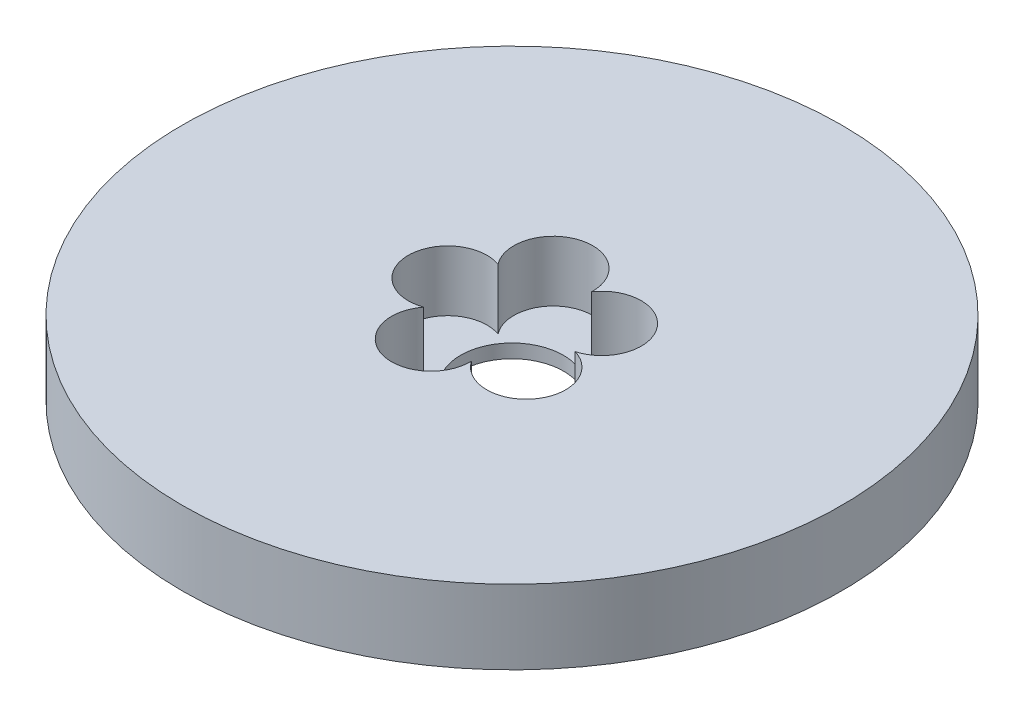
ISO-10303-21;
HEADER;
FILE_DESCRIPTION(('STEP AP214'),'2;1');
FILE_NAME('part.step','',(''),(''),'','','');
FILE_SCHEMA(('AUTOMOTIVE_DESIGN { 1 0 10303 214 1 1 1 1 }'));
ENDSEC;
DATA;
#1=APPLICATION_CONTEXT('core data for automotive mechanical design processes');
#2=APPLICATION_PROTOCOL_DEFINITION('international standard','automotive_design',2000,#1);
#3=PRODUCT_CONTEXT('',#1,'mechanical');
#4=PRODUCT('Part','Part','',(#3));
#5=PRODUCT_RELATED_PRODUCT_CATEGORY('part','',(#4));
#6=PRODUCT_DEFINITION_FORMATION('','',#4);
#7=PRODUCT_DEFINITION_CONTEXT('part definition',#1,'design');
#8=PRODUCT_DEFINITION('design','',#6,#7);
#9=PRODUCT_DEFINITION_SHAPE('','',#8);
#10=(LENGTH_UNIT() NAMED_UNIT(*) SI_UNIT(.MILLI.,.METRE.));
#11=(NAMED_UNIT(*) PLANE_ANGLE_UNIT() SI_UNIT($,.RADIAN.));
#12=(NAMED_UNIT(*) SI_UNIT($,.STERADIAN.) SOLID_ANGLE_UNIT());
#13=UNCERTAINTY_MEASURE_WITH_UNIT(LENGTH_MEASURE(1.E-05),#10,'distance_accuracy_value','');
#14=(GEOMETRIC_REPRESENTATION_CONTEXT(3) GLOBAL_UNCERTAINTY_ASSIGNED_CONTEXT((#13)) GLOBAL_UNIT_ASSIGNED_CONTEXT((#10,
#11,#12)) REPRESENTATION_CONTEXT('',''));
#15=CARTESIAN_POINT('',(0.,0.,0.));
#16=DIRECTION('',(0.,0.,1.));
#17=DIRECTION('',(1.,0.,0.));
#18=AXIS2_PLACEMENT_3D('',#15,#16,#17);
#19=CARTESIAN_POINT('',(0.,18.,0.));
#20=DIRECTION('',(0.,-1.,0.));
#21=DIRECTION('',(0.,0.,-1.));
#22=AXIS2_PLACEMENT_3D('',#19,#20,#21);
#23=CYLINDRICAL_SURFACE('',#22,12.5);
#24=CARTESIAN_POINT('',(0.,0.,0.));
#25=DIRECTION('',(0.,1.,0.));
#26=DIRECTION('',(0.,0.,1.));
#27=AXIS2_PLACEMENT_3D('',#24,#25,#26);
#28=CIRCLE('',#27,12.5);
#29=CARTESIAN_POINT('',(0.,0.,12.5));
#30=VERTEX_POINT('',#29);
#31=EDGE_CURVE('E129',#30,#30,#28,.T.);
#32=ORIENTED_EDGE('',*,*,#31,.F.);
#33=EDGE_LOOP('',(#32));
#34=FACE_BOUND('',#33,.T.);
#35=CARTESIAN_POINT('',(0.,3.32613405674812,0.));
#36=DIRECTION('',(0.,1.,0.));
#37=DIRECTION('',(0.,0.,1.));
#38=AXIS2_PLACEMENT_3D('',#35,#36,#37);
#39=CIRCLE('',#38,12.5);
#40=CARTESIAN_POINT('',(0.,3.32613405674812,12.5));
#41=VERTEX_POINT('',#40);
#42=EDGE_CURVE('E11',#41,#41,#39,.T.);
#43=ORIENTED_EDGE('',*,*,#42,.T.);
#44=EDGE_LOOP('',(#43));
#45=FACE_BOUND('',#44,.T.);
#46=ADVANCED_FACE('F39',(#34,#45),#23,.F.);
#47=CARTESIAN_POINT('',(0.,18.,0.));
#48=DIRECTION('',(0.,-1.,0.));
#49=DIRECTION('',(0.,0.,-1.));
#50=AXIS2_PLACEMENT_3D('',#47,#48,#49);
#51=CYLINDRICAL_SURFACE('',#50,80.);
#52=CARTESIAN_POINT('',(0.,18.,0.));
#53=DIRECTION('',(0.,1.,0.));
#54=DIRECTION('',(0.,0.,1.));
#55=AXIS2_PLACEMENT_3D('',#52,#53,#54);
#56=CIRCLE('',#55,80.);
#57=CARTESIAN_POINT('',(0.,18.,80.));
#58=VERTEX_POINT('',#57);
#59=EDGE_CURVE('E50',#58,#58,#56,.T.);
#60=ORIENTED_EDGE('',*,*,#59,.F.);
#61=EDGE_LOOP('',(#60));
#62=FACE_BOUND('',#61,.T.);
#63=CARTESIAN_POINT('',(0.,0.,0.));
#64=DIRECTION('',(0.,1.,0.));
#65=DIRECTION('',(0.,0.,1.));
#66=AXIS2_PLACEMENT_3D('',#63,#64,#65);
#67=CIRCLE('',#66,80.);
#68=CARTESIAN_POINT('',(0.,0.,80.));
#69=VERTEX_POINT('',#68);
#70=EDGE_CURVE('E133',#69,#69,#67,.T.);
#71=ORIENTED_EDGE('',*,*,#70,.T.);
#72=EDGE_LOOP('',(#71));
#73=FACE_BOUND('',#72,.T.);
#74=ADVANCED_FACE('F41',(#62,#73),#51,.T.);
#75=CARTESIAN_POINT('',(0.,18.,0.));
#76=DIRECTION('',(0.,1.,0.));
#77=DIRECTION('',(0.,0.,1.));
#78=AXIS2_PLACEMENT_3D('',#75,#76,#77);
#79=PLANE('',#78);
#80=CARTESIAN_POINT('',(-4.82462308431766,18.,14.8486630396803));
#81=DIRECTION('',(0.,1.,0.));
#82=DIRECTION('',(0.951056516295155,0.,0.309016994374945));
#83=AXIS2_PLACEMENT_3D('',#80,#81,#82);
#84=CIRCLE('',#83,9.57161790588408);
#85=CARTESIAN_POINT('',(-12.4193216014351,18.,9.02316531241826));
#86=VERTEX_POINT('',#85);
#87=CARTESIAN_POINT('',(4.74375873453249,18.,14.5997881616018));
#88=VERTEX_POINT('',#87);
#89=EDGE_CURVE('E119',#86,#88,#84,.T.);
#90=ORIENTED_EDGE('',*,*,#89,.F.);
#91=CARTESIAN_POINT('',(-15.6128082666668,18.,0.));
#92=DIRECTION('',(0.,1.,0.));
#93=DIRECTION('',(0.,0.,1.));
#94=AXIS2_PLACEMENT_3D('',#91,#92,#93);
#95=CIRCLE('',#94,9.57161790588408);
#96=CARTESIAN_POINT('',(-12.4193216014354,18.,-9.02316531241839));
#97=VERTEX_POINT('',#96);
#98=EDGE_CURVE('E127',#97,#86,#95,.T.);
#99=ORIENTED_EDGE('',*,*,#98,.F.);
#100=CARTESIAN_POINT('',(-4.82462308431787,18.,-14.8486630396802));
#101=DIRECTION('',(0.,1.,0.));
#102=DIRECTION('',(-0.95105651629515,0.,0.309016994374958));
#103=AXIS2_PLACEMENT_3D('',#100,#101,#102);
#104=CIRCLE('',#103,9.57161790588408);
#105=CARTESIAN_POINT('',(4.74375873453229,18.,-14.5997881616018));
#106=VERTEX_POINT('',#105);
#107=EDGE_CURVE('E53',#106,#97,#104,.T.);
#108=ORIENTED_EDGE('',*,*,#107,.F.);
#109=CARTESIAN_POINT('',(12.631027217651,18.,-9.17697844601685));
#110=DIRECTION('',(0.,1.,0.));
#111=DIRECTION('',(-0.58778525229248,0.,-0.809016994374942));
#112=AXIS2_PLACEMENT_3D('',#109,#110,#111);
#113=CIRCLE('',#112,9.57161790588408);
#114=CARTESIAN_POINT('',(15.3511257338053,18.,-1.11022302462516E-13));
#115=VERTEX_POINT('',#114);
#116=EDGE_CURVE('E99',#115,#106,#113,.T.);
#117=ORIENTED_EDGE('',*,*,#116,.F.);
#118=CARTESIAN_POINT('',(12.6310272176511,18.,9.17697844601667));
#119=DIRECTION('',(0.,1.,0.));
#120=DIRECTION('',(0.587785252292469,0.,-0.809016994374951));
#121=AXIS2_PLACEMENT_3D('',#118,#119,#120);
#122=CIRCLE('',#121,9.57161790588408);
#123=EDGE_CURVE('E113',#88,#115,#122,.T.);
#124=ORIENTED_EDGE('',*,*,#123,.F.);
#125=EDGE_LOOP('',(#90,#99,#108,#117,#124));
#126=FACE_BOUND('',#125,.T.);
#127=ORIENTED_EDGE('',*,*,#59,.T.);
#128=EDGE_LOOP('',(#127));
#129=FACE_BOUND('',#128,.T.);
#130=ADVANCED_FACE('F141',(#126,#129),#79,.T.);
#131=CARTESIAN_POINT('',(0.,0.,0.));
#132=DIRECTION('',(0.,1.,0.));
#133=DIRECTION('',(0.,0.,1.));
#134=AXIS2_PLACEMENT_3D('',#131,#132,#133);
#135=PLANE('',#134);
#136=ORIENTED_EDGE('',*,*,#31,.T.);
#137=EDGE_LOOP('',(#136));
#138=FACE_BOUND('',#137,.T.);
#139=ORIENTED_EDGE('',*,*,#70,.F.);
#140=EDGE_LOOP('',(#139));
#141=FACE_BOUND('',#140,.T.);
#142=ADVANCED_FACE('F139',(#138,#141),#135,.F.);
#143=CARTESIAN_POINT('',(-15.6128082666668,3.32613405674812,0.));
#144=DIRECTION('',(0.,1.,0.));
#145=DIRECTION('',(0.,0.,1.));
#146=AXIS2_PLACEMENT_3D('',#143,#144,#145);
#147=CYLINDRICAL_SURFACE('',#146,9.57161790588408);
#148=ORIENTED_EDGE('',*,*,#98,.T.);
#149=DIRECTION('',(0.,1.,0.));
#150=VECTOR('',#149,1.);
#151=CARTESIAN_POINT('',(-12.4193216014351,10.6630670283741,9.02316531241826));
#152=LINE('',#151,#150);
#153=CARTESIAN_POINT('',(-12.4193216014351,3.32613405674812,9.02316531241826));
#154=VERTEX_POINT('',#153);
#155=EDGE_CURVE('E65',#86,#154,#152,.F.);
#156=ORIENTED_EDGE('',*,*,#155,.T.);
#157=CARTESIAN_POINT('',(-15.6128082666668,3.32613405674812,0.));
#158=DIRECTION('',(0.,1.,0.));
#159=DIRECTION('',(0.,0.,1.));
#160=AXIS2_PLACEMENT_3D('',#157,#158,#159);
#161=CIRCLE('',#160,9.57161790588408);
#162=CARTESIAN_POINT('',(-12.4193216014354,3.32613405674812,-9.02316531241839));
#163=VERTEX_POINT('',#162);
#164=EDGE_CURVE('E130',#163,#154,#161,.T.);
#165=ORIENTED_EDGE('',*,*,#164,.F.);
#166=DIRECTION('',(0.,1.,0.));
#167=VECTOR('',#166,1.);
#168=CARTESIAN_POINT('',(-12.4193216014354,10.6630670283741,-9.02316531241839));
#169=LINE('',#168,#167);
#170=EDGE_CURVE('E108',#163,#97,#169,.T.);
#171=ORIENTED_EDGE('',*,*,#170,.T.);
#172=EDGE_LOOP('',(#148,#156,#165,#171));
#173=FACE_BOUND('',#172,.T.);
#174=ADVANCED_FACE('F142',(#173),#147,.F.);
#175=CARTESIAN_POINT('',(-15.6128082666668,3.32613405674812,0.));
#176=DIRECTION('',(0.,1.,0.));
#177=DIRECTION('',(0.,0.,1.));
#178=AXIS2_PLACEMENT_3D('',#175,#176,#177);
#179=PLANE('',#178);
#180=ORIENTED_EDGE('',*,*,#164,.T.);
#181=CARTESIAN_POINT('',(-4.82462308431766,3.32613405674812,14.8486630396803));
#182=DIRECTION('',(0.,1.,0.));
#183=DIRECTION('',(0.951056516295155,0.,0.309016994374945));
#184=AXIS2_PLACEMENT_3D('',#181,#182,#183);
#185=CIRCLE('',#184,9.57161790588408);
#186=CARTESIAN_POINT('',(4.74375873453249,3.32613405674812,14.5997881616018));
#187=VERTEX_POINT('',#186);
#188=EDGE_CURVE('E121',#154,#187,#185,.T.);
#189=ORIENTED_EDGE('',*,*,#188,.T.);
#190=CARTESIAN_POINT('',(12.6310272176511,3.32613405674812,9.17697844601667));
#191=DIRECTION('',(0.,1.,0.));
#192=DIRECTION('',(0.587785252292469,0.,-0.809016994374951));
#193=AXIS2_PLACEMENT_3D('',#190,#191,#192);
#194=CIRCLE('',#193,9.57161790588408);
#195=CARTESIAN_POINT('',(15.3511257338053,3.32613405674812,-1.11022302462516E-13));
#196=VERTEX_POINT('',#195);
#197=EDGE_CURVE('E92',#187,#196,#194,.T.);
#198=ORIENTED_EDGE('',*,*,#197,.T.);
#199=CARTESIAN_POINT('',(12.631027217651,3.32613405674812,-9.17697844601685));
#200=DIRECTION('',(0.,1.,0.));
#201=DIRECTION('',(-0.58778525229248,0.,-0.809016994374942));
#202=AXIS2_PLACEMENT_3D('',#199,#200,#201);
#203=CIRCLE('',#202,9.57161790588408);
#204=CARTESIAN_POINT('',(4.74375873453229,3.32613405674812,-14.5997881616018));
#205=VERTEX_POINT('',#204);
#206=EDGE_CURVE('E88',#196,#205,#203,.T.);
#207=ORIENTED_EDGE('',*,*,#206,.T.);
#208=CARTESIAN_POINT('',(-4.82462308431787,3.32613405674812,-14.8486630396802));
#209=DIRECTION('',(0.,1.,0.));
#210=DIRECTION('',(-0.95105651629515,0.,0.309016994374958));
#211=AXIS2_PLACEMENT_3D('',#208,#209,#210);
#212=CIRCLE('',#211,9.57161790588408);
#213=EDGE_CURVE('E95',#205,#163,#212,.T.);
#214=ORIENTED_EDGE('',*,*,#213,.T.);
#215=EDGE_LOOP('',(#180,#189,#198,#207,#214));
#216=FACE_BOUND('',#215,.T.);
#217=ORIENTED_EDGE('',*,*,#42,.F.);
#218=EDGE_LOOP('',(#217));
#219=FACE_BOUND('',#218,.T.);
#220=ADVANCED_FACE('F90',(#216,#219),#179,.T.);
#221=CARTESIAN_POINT('',(-4.82462308431766,3.32613405674812,14.8486630396803));
#222=DIRECTION('',(0.,1.,0.));
#223=DIRECTION('',(0.,0.,1.));
#224=AXIS2_PLACEMENT_3D('',#221,#222,#223);
#225=CYLINDRICAL_SURFACE('',#224,9.57161790588408);
#226=ORIENTED_EDGE('',*,*,#89,.T.);
#227=DIRECTION('',(0.,1.,0.));
#228=VECTOR('',#227,1.);
#229=CARTESIAN_POINT('',(4.74375873453249,10.6630670283741,14.5997881616018));
#230=LINE('',#229,#228);
#231=EDGE_CURVE('E106',#88,#187,#230,.F.);
#232=ORIENTED_EDGE('',*,*,#231,.T.);
#233=ORIENTED_EDGE('',*,*,#188,.F.);
#234=ORIENTED_EDGE('',*,*,#155,.F.);
#235=EDGE_LOOP('',(#226,#232,#233,#234));
#236=FACE_BOUND('',#235,.T.);
#237=ADVANCED_FACE('F164',(#236),#225,.F.);
#238=CARTESIAN_POINT('',(-4.82462308431787,3.32613405674812,-14.8486630396802));
#239=DIRECTION('',(0.,1.,0.));
#240=DIRECTION('',(0.,0.,1.));
#241=AXIS2_PLACEMENT_3D('',#238,#239,#240);
#242=CYLINDRICAL_SURFACE('',#241,9.57161790588408);
#243=ORIENTED_EDGE('',*,*,#213,.F.);
#244=DIRECTION('',(0.,1.,0.));
#245=VECTOR('',#244,1.);
#246=CARTESIAN_POINT('',(4.74375873453229,10.6630670283741,-14.5997881616018));
#247=LINE('',#246,#245);
#248=EDGE_CURVE('E103',#106,#205,#247,.F.);
#249=ORIENTED_EDGE('',*,*,#248,.F.);
#250=ORIENTED_EDGE('',*,*,#107,.T.);
#251=ORIENTED_EDGE('',*,*,#170,.F.);
#252=EDGE_LOOP('',(#243,#249,#250,#251));
#253=FACE_BOUND('',#252,.T.);
#254=ADVANCED_FACE('F107',(#253),#242,.F.);
#255=CARTESIAN_POINT('',(12.6310272176511,3.32613405674812,9.17697844601667));
#256=DIRECTION('',(0.,1.,0.));
#257=DIRECTION('',(0.,0.,1.));
#258=AXIS2_PLACEMENT_3D('',#255,#256,#257);
#259=CYLINDRICAL_SURFACE('',#258,9.57161790588408);
#260=ORIENTED_EDGE('',*,*,#123,.T.);
#261=DIRECTION('',(0.,1.,0.));
#262=VECTOR('',#261,1.);
#263=CARTESIAN_POINT('',(15.3511257338053,10.6630670283741,-1.11022302462516E-13));
#264=LINE('',#263,#262);
#265=EDGE_CURVE('E97',#115,#196,#264,.F.);
#266=ORIENTED_EDGE('',*,*,#265,.T.);
#267=ORIENTED_EDGE('',*,*,#197,.F.);
#268=ORIENTED_EDGE('',*,*,#231,.F.);
#269=EDGE_LOOP('',(#260,#266,#267,#268));
#270=FACE_BOUND('',#269,.T.);
#271=ADVANCED_FACE('F169',(#270),#259,.F.);
#272=CARTESIAN_POINT('',(12.631027217651,3.32613405674812,-9.17697844601685));
#273=DIRECTION('',(0.,1.,0.));
#274=DIRECTION('',(0.,0.,1.));
#275=AXIS2_PLACEMENT_3D('',#272,#273,#274);
#276=CYLINDRICAL_SURFACE('',#275,9.57161790588408);
#277=ORIENTED_EDGE('',*,*,#248,.T.);
#278=ORIENTED_EDGE('',*,*,#206,.F.);
#279=ORIENTED_EDGE('',*,*,#265,.F.);
#280=ORIENTED_EDGE('',*,*,#116,.T.);
#281=EDGE_LOOP('',(#277,#278,#279,#280));
#282=FACE_BOUND('',#281,.T.);
#283=ADVANCED_FACE('F102',(#282),#276,.F.);
#284=CLOSED_SHELL('',(#46,#74,#130,#142,#174,#220,#237,#254,#271,#283));
#285=MANIFOLD_SOLID_BREP('B2',#284);
#286=ADVANCED_BREP_SHAPE_REPRESENTATION('',(#18,#285),#14);
#287=SHAPE_DEFINITION_REPRESENTATION(#9,#286);
ENDSEC;
END-ISO-10303-21;
